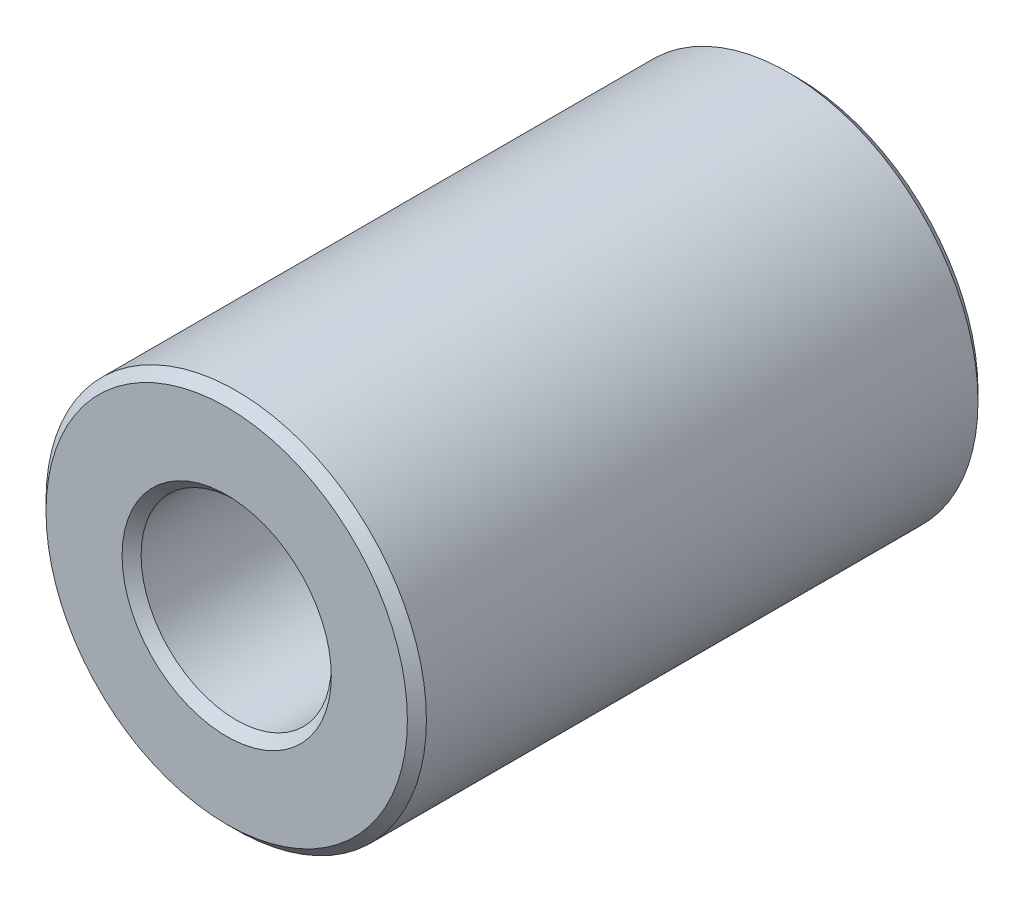
ISO-10303-21;
HEADER;
FILE_DESCRIPTION(('STEP AP214'),'2;1');
FILE_NAME('part.step','',(''),(''),'','','');
FILE_SCHEMA(('AUTOMOTIVE_DESIGN { 1 0 10303 214 1 1 1 1 }'));
ENDSEC;
DATA;
#1=APPLICATION_CONTEXT('core data for automotive mechanical design processes');
#2=APPLICATION_PROTOCOL_DEFINITION('international standard','automotive_design',2000,#1);
#3=PRODUCT_CONTEXT('',#1,'mechanical');
#4=PRODUCT('Part','Part','',(#3));
#5=PRODUCT_RELATED_PRODUCT_CATEGORY('part','',(#4));
#6=PRODUCT_DEFINITION_FORMATION('','',#4);
#7=PRODUCT_DEFINITION_CONTEXT('part definition',#1,'design');
#8=PRODUCT_DEFINITION('design','',#6,#7);
#9=PRODUCT_DEFINITION_SHAPE('','',#8);
#10=(LENGTH_UNIT() NAMED_UNIT(*) SI_UNIT(.MILLI.,.METRE.));
#11=(NAMED_UNIT(*) PLANE_ANGLE_UNIT() SI_UNIT($,.RADIAN.));
#12=(NAMED_UNIT(*) SI_UNIT($,.STERADIAN.) SOLID_ANGLE_UNIT());
#13=UNCERTAINTY_MEASURE_WITH_UNIT(LENGTH_MEASURE(1.E-05),#10,'distance_accuracy_value','');
#14=(GEOMETRIC_REPRESENTATION_CONTEXT(3) GLOBAL_UNCERTAINTY_ASSIGNED_CONTEXT((#13)) GLOBAL_UNIT_ASSIGNED_CONTEXT((#10,
#11,#12)) REPRESENTATION_CONTEXT('',''));
#15=CARTESIAN_POINT('',(0.,0.,0.));
#16=DIRECTION('',(0.,0.,1.));
#17=DIRECTION('',(1.,0.,0.));
#18=AXIS2_PLACEMENT_3D('',#15,#16,#17);
#19=CARTESIAN_POINT('',(-0.2166088223,-17.0652643177,144.78));
#20=DIRECTION('',(0.,0.,-1.));
#21=DIRECTION('',(-1.,0.,0.));
#22=AXIS2_PLACEMENT_3D('',#19,#20,#21);
#23=CYLINDRICAL_SURFACE('',#22,1.);
#24=CARTESIAN_POINT('',(-0.2166088223,-17.0652643177,138.98000000006));
#25=DIRECTION('',(0.,0.,-1.));
#26=DIRECTION('',(0.,1.,0.));
#27=AXIS2_PLACEMENT_3D('',#24,#25,#26);
#28=CIRCLE('',#27,0.999999999982733);
#29=CARTESIAN_POINT('',(-0.2166088223,-16.0652643177173,138.98000000006));
#30=VERTEX_POINT('',#29);
#31=EDGE_CURVE('E31',#30,#30,#28,.T.);
#32=ORIENTED_EDGE('',*,*,#31,.T.);
#33=EDGE_LOOP('',(#32));
#34=FACE_BOUND('',#33,.T.);
#35=CARTESIAN_POINT('',(-0.2166088223,-17.0652643177,144.779999999969));
#36=DIRECTION('',(0.,0.,1.));
#37=DIRECTION('',(0.,1.,0.));
#38=AXIS2_PLACEMENT_3D('',#35,#36,#37);
#39=CIRCLE('',#38,1.00000000009642);
#40=CARTESIAN_POINT('',(-0.216608822299999,-16.0652643176036,144.779999999969));
#41=VERTEX_POINT('',#40);
#42=EDGE_CURVE('E28',#41,#41,#39,.T.);
#43=ORIENTED_EDGE('',*,*,#42,.T.);
#44=EDGE_LOOP('',(#43));
#45=FACE_BOUND('',#44,.T.);
#46=ADVANCED_FACE('F13',(#34,#45),#23,.F.);
#47=CARTESIAN_POINT('',(-0.2166088223,-17.0652643177,138.880000000029));
#48=DIRECTION('',(0.,0.,-1.));
#49=DIRECTION('',(-1.,0.,0.));
#50=AXIS2_PLACEMENT_3D('',#47,#48,#49);
#51=CONICAL_SURFACE('',#50,1.09999999995763,0.785398163113231);
#52=CARTESIAN_POINT('',(-0.2166088223,-17.0652643177,138.880000000029));
#53=DIRECTION('',(0.,0.,-1.));
#54=DIRECTION('',(-1.,0.,0.));
#55=AXIS2_PLACEMENT_3D('',#52,#53,#54);
#56=CIRCLE('',#55,1.09999999995763);
#57=CARTESIAN_POINT('',(-1.31660882225763,-17.0652643177,138.880000000029));
#58=VERTEX_POINT('',#57);
#59=EDGE_CURVE('E16',#58,#58,#56,.T.);
#60=ORIENTED_EDGE('',*,*,#59,.T.);
#61=EDGE_LOOP('',(#60));
#62=FACE_BOUND('',#61,.T.);
#63=ORIENTED_EDGE('',*,*,#31,.F.);
#64=EDGE_LOOP('',(#63));
#65=FACE_BOUND('',#64,.T.);
#66=ADVANCED_FACE('F45',(#62,#65),#51,.F.);
#67=CARTESIAN_POINT('',(-0.2166088223,-17.0652643177,144.879999999773));
#68=DIRECTION('',(0.,0.,1.));
#69=DIRECTION('',(1.,0.,0.));
#70=AXIS2_PLACEMENT_3D('',#67,#68,#69);
#71=CONICAL_SURFACE('',#70,1.09999999990079,0.785398163397448);
#72=ORIENTED_EDGE('',*,*,#42,.F.);
#73=EDGE_LOOP('',(#72));
#74=FACE_BOUND('',#73,.T.);
#75=CARTESIAN_POINT('',(-0.2166088223,-17.0652643177,144.879999999887));
#76=DIRECTION('',(0.,0.,1.));
#77=DIRECTION('',(1.,0.,0.));
#78=AXIS2_PLACEMENT_3D('',#75,#76,#77);
#79=CIRCLE('',#78,1.10000000001447);
#80=CARTESIAN_POINT('',(0.883391177714475,-17.0652643177,144.879999999887));
#81=VERTEX_POINT('',#80);
#82=EDGE_CURVE('E38',#81,#81,#79,.F.);
#83=ORIENTED_EDGE('',*,*,#82,.F.);
#84=EDGE_LOOP('',(#83));
#85=FACE_BOUND('',#84,.T.);
#86=ADVANCED_FACE('F51',(#74,#85),#71,.F.);
#87=CARTESIAN_POINT('',(-0.2166088223,-17.0652643177,138.88));
#88=DIRECTION('',(0.,0.,1.));
#89=DIRECTION('',(1.,0.,0.));
#90=AXIS2_PLACEMENT_3D('',#87,#88,#89);
#91=PLANE('',#90);
#92=CARTESIAN_POINT('',(-0.2166088223,-17.0652643177,138.879999999915));
#93=DIRECTION('',(0.,0.,1.));
#94=DIRECTION('',(1.,0.,0.));
#95=AXIS2_PLACEMENT_3D('',#92,#93,#94);
#96=CIRCLE('',#95,1.90000000004103);
#97=CARTESIAN_POINT('',(1.68339117774103,-17.0652643177,138.879999999915));
#98=VERTEX_POINT('',#97);
#99=EDGE_CURVE('E36',#98,#98,#96,.T.);
#100=ORIENTED_EDGE('',*,*,#99,.F.);
#101=EDGE_LOOP('',(#100));
#102=FACE_BOUND('',#101,.T.);
#103=ORIENTED_EDGE('',*,*,#59,.F.);
#104=EDGE_LOOP('',(#103));
#105=FACE_BOUND('',#104,.T.);
#106=ADVANCED_FACE('F48',(#102,#105),#91,.F.);
#107=CARTESIAN_POINT('',(-0.2166088223,-17.0652643177,144.88));
#108=DIRECTION('',(0.,0.,1.));
#109=DIRECTION('',(1.,0.,0.));
#110=AXIS2_PLACEMENT_3D('',#107,#108,#109);
#111=PLANE('',#110);
#112=ORIENTED_EDGE('',*,*,#82,.T.);
#113=EDGE_LOOP('',(#112));
#114=FACE_BOUND('',#113,.T.);
#115=CARTESIAN_POINT('',(-0.2166088223,-17.0652643177,144.880000000001));
#116=DIRECTION('',(0.,0.,-1.));
#117=DIRECTION('',(-1.,0.,0.));
#118=AXIS2_PLACEMENT_3D('',#115,#116,#117);
#119=CIRCLE('',#118,1.90000000004103);
#120=CARTESIAN_POINT('',(-2.11660882234103,-17.0652643177,144.880000000001));
#121=VERTEX_POINT('',#120);
#122=EDGE_CURVE('E25',#121,#121,#119,.T.);
#123=ORIENTED_EDGE('',*,*,#122,.F.);
#124=EDGE_LOOP('',(#123));
#125=FACE_BOUND('',#124,.T.);
#126=ADVANCED_FACE('F50',(#114,#125),#111,.T.);
#127=CARTESIAN_POINT('',(-0.2166088223,-17.0652643177,138.979999999947));
#128=DIRECTION('',(0.,0.,1.));
#129=DIRECTION('',(1.,0.,0.));
#130=AXIS2_PLACEMENT_3D('',#127,#128,#129);
#131=CONICAL_SURFACE('',#130,2.00000000007277,0.785398163397448);
#132=CARTESIAN_POINT('',(-0.2166088223,-17.0652643177,138.98));
#133=DIRECTION('',(0.,0.,1.));
#134=DIRECTION('',(1.,0.,0.));
#135=AXIS2_PLACEMENT_3D('',#132,#133,#134);
#136=CIRCLE('',#135,2.);
#137=CARTESIAN_POINT('',(1.7833911777,-17.0652643177,138.98));
#138=VERTEX_POINT('',#137);
#139=EDGE_CURVE('E20',#138,#138,#136,.T.);
#140=ORIENTED_EDGE('',*,*,#139,.F.);
#141=EDGE_LOOP('',(#140));
#142=FACE_BOUND('',#141,.T.);
#143=ORIENTED_EDGE('',*,*,#99,.T.);
#144=EDGE_LOOP('',(#143));
#145=FACE_BOUND('',#144,.T.);
#146=ADVANCED_FACE('F59',(#142,#145),#131,.T.);
#147=CARTESIAN_POINT('',(-0.2166088223,-17.0652643177,144.779999999969));
#148=DIRECTION('',(0.,0.,-1.));
#149=DIRECTION('',(-1.,0.,0.));
#150=AXIS2_PLACEMENT_3D('',#147,#148,#149);
#151=CONICAL_SURFACE('',#150,2.00000000001593,0.785398163113231);
#152=ORIENTED_EDGE('',*,*,#122,.T.);
#153=EDGE_LOOP('',(#152));
#154=FACE_BOUND('',#153,.T.);
#155=CARTESIAN_POINT('',(-0.216608822299999,-17.0652643177,144.78));
#156=DIRECTION('',(0.,0.,1.));
#157=DIRECTION('',(1.,0.,0.));
#158=AXIS2_PLACEMENT_3D('',#155,#156,#157);
#159=CIRCLE('',#158,2.);
#160=CARTESIAN_POINT('',(1.7833911777,-17.0652643177,144.78));
#161=VERTEX_POINT('',#160);
#162=EDGE_CURVE('E9',#161,#161,#159,.F.);
#163=ORIENTED_EDGE('',*,*,#162,.F.);
#164=EDGE_LOOP('',(#163));
#165=FACE_BOUND('',#164,.T.);
#166=ADVANCED_FACE('F66',(#154,#165),#151,.T.);
#167=CARTESIAN_POINT('',(-0.2166088223,-17.0652643177,138.98));
#168=DIRECTION('',(0.,0.,1.));
#169=DIRECTION('',(1.,0.,0.));
#170=AXIS2_PLACEMENT_3D('',#167,#168,#169);
#171=CYLINDRICAL_SURFACE('',#170,2.);
#172=ORIENTED_EDGE('',*,*,#162,.T.);
#173=EDGE_LOOP('',(#172));
#174=FACE_BOUND('',#173,.T.);
#175=ORIENTED_EDGE('',*,*,#139,.T.);
#176=EDGE_LOOP('',(#175));
#177=FACE_BOUND('',#176,.T.);
#178=ADVANCED_FACE('F64',(#174,#177),#171,.T.);
#179=CLOSED_SHELL('',(#46,#66,#86,#106,#126,#146,#166,#178));
#180=MANIFOLD_SOLID_BREP('B1',#179);
#181=ADVANCED_BREP_SHAPE_REPRESENTATION('',(#18,#180),#14);
#182=SHAPE_DEFINITION_REPRESENTATION(#9,#181);
ENDSEC;
END-ISO-10303-21;
